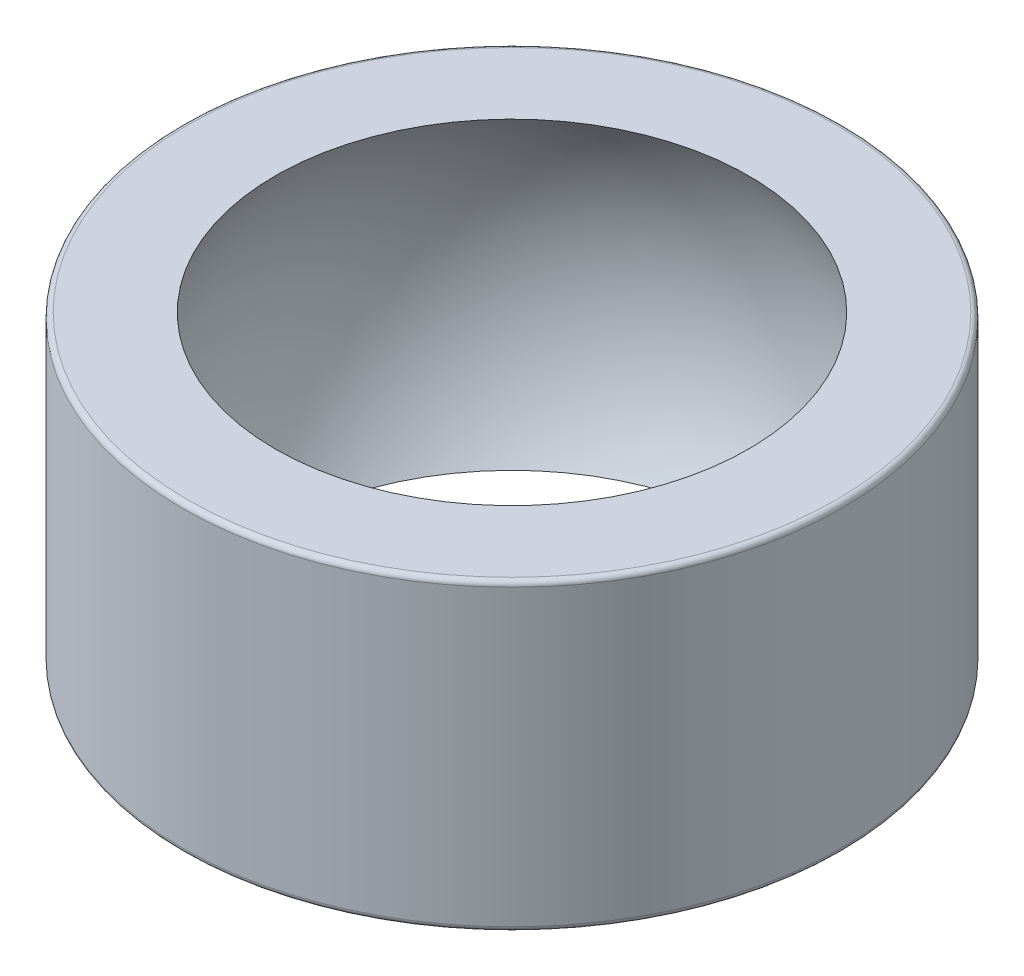
ISO-10303-21;
HEADER;
FILE_DESCRIPTION(('STEP AP214'),'2;1');
FILE_NAME('part.step','',(''),(''),'','','');
FILE_SCHEMA(('AUTOMOTIVE_DESIGN { 1 0 10303 214 1 1 1 1 }'));
ENDSEC;
DATA;
#1=APPLICATION_CONTEXT('core data for automotive mechanical design processes');
#2=APPLICATION_PROTOCOL_DEFINITION('international standard','automotive_design',2000,#1);
#3=PRODUCT_CONTEXT('',#1,'mechanical');
#4=PRODUCT('Part','Part','',(#3));
#5=PRODUCT_RELATED_PRODUCT_CATEGORY('part','',(#4));
#6=PRODUCT_DEFINITION_FORMATION('','',#4);
#7=PRODUCT_DEFINITION_CONTEXT('part definition',#1,'design');
#8=PRODUCT_DEFINITION('design','',#6,#7);
#9=PRODUCT_DEFINITION_SHAPE('','',#8);
#10=(LENGTH_UNIT() NAMED_UNIT(*) SI_UNIT(.MILLI.,.METRE.));
#11=(NAMED_UNIT(*) PLANE_ANGLE_UNIT() SI_UNIT($,.RADIAN.));
#12=(NAMED_UNIT(*) SI_UNIT($,.STERADIAN.) SOLID_ANGLE_UNIT());
#13=UNCERTAINTY_MEASURE_WITH_UNIT(LENGTH_MEASURE(1.E-05),#10,'distance_accuracy_value','');
#14=(GEOMETRIC_REPRESENTATION_CONTEXT(3) GLOBAL_UNCERTAINTY_ASSIGNED_CONTEXT((#13)) GLOBAL_UNIT_ASSIGNED_CONTEXT((#10,
#11,#12)) REPRESENTATION_CONTEXT('',''));
#15=CARTESIAN_POINT('',(0.,0.,0.));
#16=DIRECTION('',(0.,0.,1.));
#17=DIRECTION('',(1.,0.,0.));
#18=AXIS2_PLACEMENT_3D('',#15,#16,#17);
#19=CARTESIAN_POINT('',(0.,6.,0.));
#20=DIRECTION('',(0.,-1.,0.));
#21=DIRECTION('',(0.,0.,-1.));
#22=AXIS2_PLACEMENT_3D('',#19,#20,#21);
#23=CYLINDRICAL_SURFACE('',#22,13.);
#24=CARTESIAN_POINT('',(0.,-5.8,0.));
#25=DIRECTION('',(0.,1.,0.));
#26=DIRECTION('',(0.,0.,1.));
#27=AXIS2_PLACEMENT_3D('',#24,#25,#26);
#28=CIRCLE('',#27,13.);
#29=CARTESIAN_POINT('',(0.,-5.8,13.));
#30=VERTEX_POINT('',#29);
#31=EDGE_CURVE('E43',#30,#30,#28,.T.);
#32=ORIENTED_EDGE('',*,*,#31,.T.);
#33=EDGE_LOOP('',(#32));
#34=FACE_BOUND('',#33,.T.);
#35=CARTESIAN_POINT('',(0.,5.8,0.));
#36=DIRECTION('',(0.,1.,0.));
#37=DIRECTION('',(0.,0.,1.));
#38=AXIS2_PLACEMENT_3D('',#35,#36,#37);
#39=CIRCLE('',#38,13.);
#40=CARTESIAN_POINT('',(0.,5.8,13.));
#41=VERTEX_POINT('',#40);
#42=EDGE_CURVE('E47',#41,#41,#39,.F.);
#43=ORIENTED_EDGE('',*,*,#42,.T.);
#44=EDGE_LOOP('',(#43));
#45=FACE_BOUND('',#44,.T.);
#46=ADVANCED_FACE('F32',(#34,#45),#23,.T.);
#47=CARTESIAN_POINT('',(0.,6.,0.));
#48=DIRECTION('',(0.,1.,0.));
#49=DIRECTION('',(0.,0.,1.));
#50=AXIS2_PLACEMENT_3D('',#47,#48,#49);
#51=PLANE('',#50);
#52=CARTESIAN_POINT('',(0.,6.,0.));
#53=DIRECTION('',(0.,1.,0.));
#54=DIRECTION('',(0.,0.,1.));
#55=AXIS2_PLACEMENT_3D('',#52,#53,#54);
#56=CIRCLE('',#55,12.8);
#57=CARTESIAN_POINT('',(0.,6.,12.8));
#58=VERTEX_POINT('',#57);
#59=EDGE_CURVE('E10',#58,#58,#56,.T.);
#60=ORIENTED_EDGE('',*,*,#59,.T.);
#61=EDGE_LOOP('',(#60));
#62=FACE_BOUND('',#61,.T.);
#63=CARTESIAN_POINT('',(0.,6.,0.));
#64=DIRECTION('',(0.,1.,0.));
#65=DIRECTION('',(0.,0.,1.));
#66=AXIS2_PLACEMENT_3D('',#63,#64,#65);
#67=CIRCLE('',#66,9.33862944976403);
#68=CARTESIAN_POINT('',(0.,6.,9.33862944976403));
#69=VERTEX_POINT('',#68);
#70=EDGE_CURVE('E52',#69,#69,#67,.T.);
#71=ORIENTED_EDGE('',*,*,#70,.F.);
#72=EDGE_LOOP('',(#71));
#73=FACE_BOUND('',#72,.T.);
#74=ADVANCED_FACE('F62',(#62,#73),#51,.T.);
#75=CARTESIAN_POINT('',(0.,-6.,0.));
#76=DIRECTION('',(0.,1.,0.));
#77=DIRECTION('',(0.,0.,1.));
#78=AXIS2_PLACEMENT_3D('',#75,#76,#77);
#79=PLANE('',#78);
#80=CARTESIAN_POINT('',(0.,-6.,0.));
#81=DIRECTION('',(0.,1.,0.));
#82=DIRECTION('',(0.,0.,1.));
#83=AXIS2_PLACEMENT_3D('',#80,#81,#82);
#84=CIRCLE('',#83,12.8);
#85=CARTESIAN_POINT('',(0.,-6.,12.8));
#86=VERTEX_POINT('',#85);
#87=EDGE_CURVE('E39',#86,#86,#84,.F.);
#88=ORIENTED_EDGE('',*,*,#87,.T.);
#89=EDGE_LOOP('',(#88));
#90=FACE_BOUND('',#89,.T.);
#91=CARTESIAN_POINT('',(0.,-6.,0.));
#92=DIRECTION('',(0.,1.,0.));
#93=DIRECTION('',(0.,0.,1.));
#94=AXIS2_PLACEMENT_3D('',#91,#92,#93);
#95=CIRCLE('',#94,9.33862944976403);
#96=CARTESIAN_POINT('',(0.,-6.,9.33862944976403));
#97=VERTEX_POINT('',#96);
#98=EDGE_CURVE('E53',#97,#97,#95,.T.);
#99=ORIENTED_EDGE('',*,*,#98,.T.);
#100=EDGE_LOOP('',(#99));
#101=FACE_BOUND('',#100,.T.);
#102=ADVANCED_FACE('F64',(#90,#101),#79,.F.);
#103=CARTESIAN_POINT('',(0.,0.,0.));
#104=DIRECTION('',(0.,-1.,0.));
#105=DIRECTION('',(-1.,0.,0.));
#106=AXIS2_PLACEMENT_3D('',#103,#104,#105);
#107=SPHERICAL_SURFACE('',#106,11.1);
#108=ORIENTED_EDGE('',*,*,#70,.T.);
#109=EDGE_LOOP('',(#108));
#110=FACE_BOUND('',#109,.T.);
#111=ORIENTED_EDGE('',*,*,#98,.F.);
#112=EDGE_LOOP('',(#111));
#113=FACE_BOUND('',#112,.T.);
#114=ADVANCED_FACE('F59',(#110,#113),#107,.F.);
#115=CARTESIAN_POINT('',(0.,-5.8,0.));
#116=DIRECTION('',(0.,1.,0.));
#117=DIRECTION('',(0.,0.,1.));
#118=AXIS2_PLACEMENT_3D('',#115,#116,#117);
#119=TOROIDAL_SURFACE('',#118,12.8,0.2);
#120=ORIENTED_EDGE('',*,*,#87,.F.);
#121=EDGE_LOOP('',(#120));
#122=FACE_BOUND('',#121,.T.);
#123=ORIENTED_EDGE('',*,*,#31,.F.);
#124=EDGE_LOOP('',(#123));
#125=FACE_BOUND('',#124,.T.);
#126=ADVANCED_FACE('F74',(#122,#125),#119,.T.);
#127=CARTESIAN_POINT('',(0.,5.8,0.));
#128=DIRECTION('',(0.,1.,0.));
#129=DIRECTION('',(0.,0.,1.));
#130=AXIS2_PLACEMENT_3D('',#127,#128,#129);
#131=TOROIDAL_SURFACE('',#130,12.8,0.2);
#132=ORIENTED_EDGE('',*,*,#42,.F.);
#133=EDGE_LOOP('',(#132));
#134=FACE_BOUND('',#133,.T.);
#135=ORIENTED_EDGE('',*,*,#59,.F.);
#136=EDGE_LOOP('',(#135));
#137=FACE_BOUND('',#136,.T.);
#138=ADVANCED_FACE('F34',(#134,#137),#131,.T.);
#139=CLOSED_SHELL('',(#46,#74,#102,#114,#126,#138));
#140=MANIFOLD_SOLID_BREP('B2',#139);
#141=ADVANCED_BREP_SHAPE_REPRESENTATION('',(#18,#140),#14);
#142=SHAPE_DEFINITION_REPRESENTATION(#9,#141);
ENDSEC;
END-ISO-10303-21;
